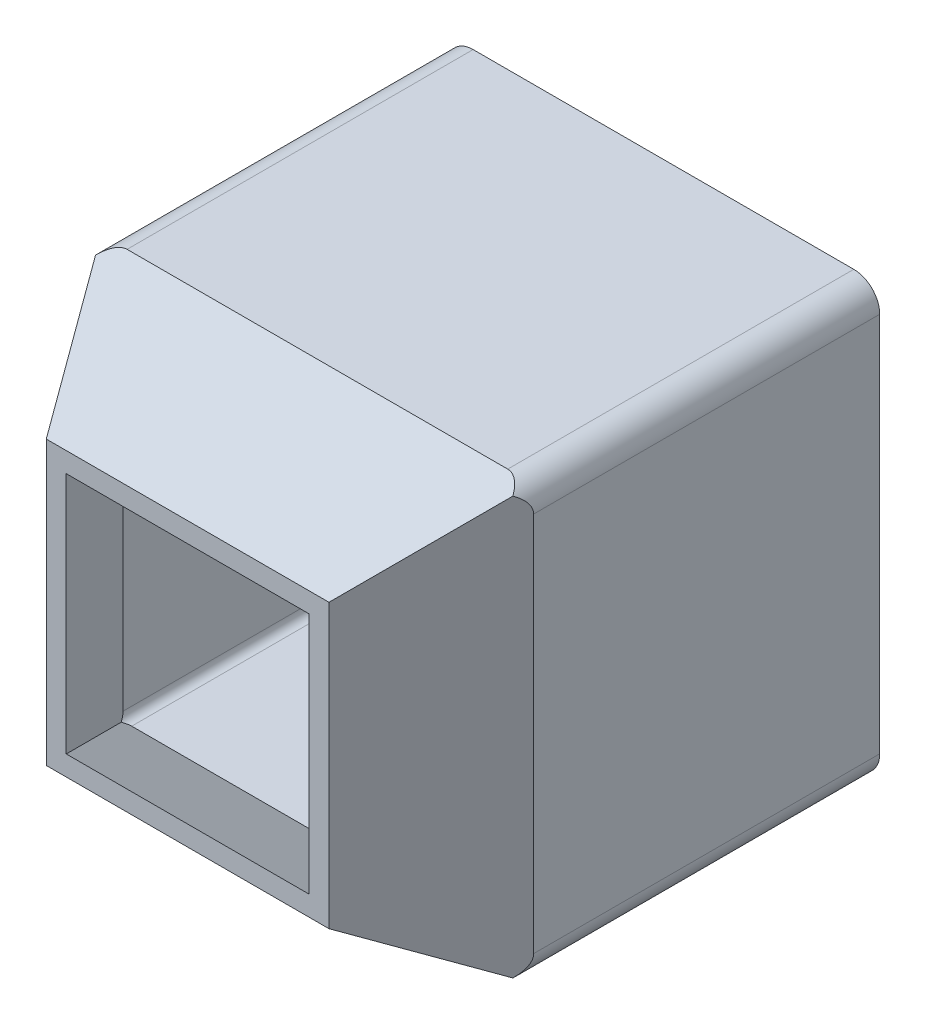
ISO-10303-21;
HEADER;
FILE_DESCRIPTION(('STEP AP214'),'2;1');
FILE_NAME('part.step','',(''),(''),'','','');
FILE_SCHEMA(('AUTOMOTIVE_DESIGN { 1 0 10303 214 1 1 1 1 }'));
ENDSEC;
DATA;
#1=APPLICATION_CONTEXT('core data for automotive mechanical design processes');
#2=APPLICATION_PROTOCOL_DEFINITION('international standard','automotive_design',2000,#1);
#3=PRODUCT_CONTEXT('',#1,'mechanical');
#4=PRODUCT('Part','Part','',(#3));
#5=PRODUCT_RELATED_PRODUCT_CATEGORY('part','',(#4));
#6=PRODUCT_DEFINITION_FORMATION('','',#4);
#7=PRODUCT_DEFINITION_CONTEXT('part definition',#1,'design');
#8=PRODUCT_DEFINITION('design','',#6,#7);
#9=PRODUCT_DEFINITION_SHAPE('','',#8);
#10=(LENGTH_UNIT() NAMED_UNIT(*) SI_UNIT(.MILLI.,.METRE.));
#11=(NAMED_UNIT(*) PLANE_ANGLE_UNIT() SI_UNIT($,.RADIAN.));
#12=(NAMED_UNIT(*) SI_UNIT($,.STERADIAN.) SOLID_ANGLE_UNIT());
#13=UNCERTAINTY_MEASURE_WITH_UNIT(LENGTH_MEASURE(1.E-05),#10,'distance_accuracy_value','');
#14=(GEOMETRIC_REPRESENTATION_CONTEXT(3) GLOBAL_UNCERTAINTY_ASSIGNED_CONTEXT((#13)) GLOBAL_UNIT_ASSIGNED_CONTEXT((#10,
#11,#12)) REPRESENTATION_CONTEXT('',''));
#15=CARTESIAN_POINT('',(0.,0.,0.));
#16=DIRECTION('',(0.,0.,1.));
#17=DIRECTION('',(1.,0.,0.));
#18=AXIS2_PLACEMENT_3D('',#15,#16,#17);
#19=CARTESIAN_POINT('',(0.,0.,-40.));
#20=DIRECTION('',(0.,0.,1.));
#21=DIRECTION('',(1.,0.,0.));
#22=AXIS2_PLACEMENT_3D('',#19,#20,#21);
#23=PLANE('',#22);
#24=DIRECTION('',(1.,0.,0.));
#25=VECTOR('',#24,1.);
#26=CARTESIAN_POINT('',(-20.,7.5,-40.));
#27=LINE('',#26,#25);
#28=CARTESIAN_POINT('',(-17.,7.5,-40.));
#29=VERTEX_POINT('',#28);
#30=CARTESIAN_POINT('',(27.,7.5,-40.));
#31=VERTEX_POINT('',#30);
#32=EDGE_CURVE('E318',#29,#31,#27,.T.);
#33=ORIENTED_EDGE('',*,*,#32,.F.);
#34=CARTESIAN_POINT('',(-17.,10.5,-40.));
#35=DIRECTION('',(0.,0.,1.));
#36=DIRECTION('',(1.,0.,0.));
#37=AXIS2_PLACEMENT_3D('',#34,#35,#36);
#38=CIRCLE('',#37,3.);
#39=CARTESIAN_POINT('',(-20.,10.5,-40.));
#40=VERTEX_POINT('',#39);
#41=EDGE_CURVE('E355',#29,#40,#38,.F.);
#42=ORIENTED_EDGE('',*,*,#41,.T.);
#43=DIRECTION('',(0.,-1.,0.));
#44=VECTOR('',#43,1.);
#45=CARTESIAN_POINT('',(-20.,57.5,-40.));
#46=LINE('',#45,#44);
#47=CARTESIAN_POINT('',(-20.,54.5,-40.));
#48=VERTEX_POINT('',#47);
#49=EDGE_CURVE('E315',#48,#40,#46,.T.);
#50=ORIENTED_EDGE('',*,*,#49,.F.);
#51=CARTESIAN_POINT('',(-17.,54.5,-40.));
#52=DIRECTION('',(0.,0.,1.));
#53=DIRECTION('',(1.,0.,0.));
#54=AXIS2_PLACEMENT_3D('',#51,#52,#53);
#55=CIRCLE('',#54,3.);
#56=CARTESIAN_POINT('',(-17.,57.5,-40.));
#57=VERTEX_POINT('',#56);
#58=EDGE_CURVE('E349',#48,#57,#55,.F.);
#59=ORIENTED_EDGE('',*,*,#58,.T.);
#60=DIRECTION('',(-1.,0.,0.));
#61=VECTOR('',#60,1.);
#62=CARTESIAN_POINT('',(-20.,57.5,-40.));
#63=LINE('',#62,#61);
#64=CARTESIAN_POINT('',(27.,57.5,-40.));
#65=VERTEX_POINT('',#64);
#66=EDGE_CURVE('E311',#65,#57,#63,.T.);
#67=ORIENTED_EDGE('',*,*,#66,.F.);
#68=CARTESIAN_POINT('',(27.,54.5,-40.));
#69=DIRECTION('',(0.,0.,1.));
#70=DIRECTION('',(1.,0.,0.));
#71=AXIS2_PLACEMENT_3D('',#68,#69,#70);
#72=CIRCLE('',#71,3.);
#73=CARTESIAN_POINT('',(30.,54.5,-40.));
#74=VERTEX_POINT('',#73);
#75=EDGE_CURVE('E351',#65,#74,#72,.F.);
#76=ORIENTED_EDGE('',*,*,#75,.T.);
#77=DIRECTION('',(0.,1.,0.));
#78=VECTOR('',#77,1.);
#79=CARTESIAN_POINT('',(30.,57.5,-40.));
#80=LINE('',#79,#78);
#81=CARTESIAN_POINT('',(30.,10.5,-40.));
#82=VERTEX_POINT('',#81);
#83=EDGE_CURVE('E308',#82,#74,#80,.T.);
#84=ORIENTED_EDGE('',*,*,#83,.F.);
#85=CARTESIAN_POINT('',(27.,10.5,-40.));
#86=DIRECTION('',(0.,0.,1.));
#87=DIRECTION('',(1.,0.,0.));
#88=AXIS2_PLACEMENT_3D('',#85,#86,#87);
#89=CIRCLE('',#88,3.);
#90=EDGE_CURVE('E353',#82,#31,#89,.F.);
#91=ORIENTED_EDGE('',*,*,#90,.T.);
#92=EDGE_LOOP('',(#33,#42,#50,#59,#67,#76,#84,#91));
#93=FACE_BOUND('',#92,.T.);
#94=CARTESIAN_POINT('',(-17.,10.5,-40.));
#95=DIRECTION('',(0.,0.,1.));
#96=DIRECTION('',(1.,0.,0.));
#97=AXIS2_PLACEMENT_3D('',#94,#95,#96);
#98=CIRCLE('',#97,1.);
#99=CARTESIAN_POINT('',(-17.,9.5,-40.));
#100=VERTEX_POINT('',#99);
#101=CARTESIAN_POINT('',(-18.,10.5,-40.));
#102=VERTEX_POINT('',#101);
#103=EDGE_CURVE('E225',#100,#102,#98,.F.);
#104=ORIENTED_EDGE('',*,*,#103,.F.);
#105=DIRECTION('',(1.,0.,0.));
#106=VECTOR('',#105,1.);
#107=CARTESIAN_POINT('',(0.,9.5,-40.));
#108=LINE('',#107,#106);
#109=CARTESIAN_POINT('',(27.,9.5,-40.));
#110=VERTEX_POINT('',#109);
#111=EDGE_CURVE('E253',#100,#110,#108,.T.);
#112=ORIENTED_EDGE('',*,*,#111,.T.);
#113=CARTESIAN_POINT('',(27.,10.5,-40.));
#114=DIRECTION('',(0.,0.,1.));
#115=DIRECTION('',(1.,0.,0.));
#116=AXIS2_PLACEMENT_3D('',#113,#114,#115);
#117=CIRCLE('',#116,1.);
#118=CARTESIAN_POINT('',(28.,10.5,-40.));
#119=VERTEX_POINT('',#118);
#120=EDGE_CURVE('E267',#119,#110,#117,.F.);
#121=ORIENTED_EDGE('',*,*,#120,.F.);
#122=DIRECTION('',(0.,1.,0.));
#123=VECTOR('',#122,1.);
#124=CARTESIAN_POINT('',(28.,0.,-40.));
#125=LINE('',#124,#123);
#126=CARTESIAN_POINT('',(28.,54.5,-40.));
#127=VERTEX_POINT('',#126);
#128=EDGE_CURVE('E47',#119,#127,#125,.T.);
#129=ORIENTED_EDGE('',*,*,#128,.T.);
#130=CARTESIAN_POINT('',(27.,54.5,-40.));
#131=DIRECTION('',(0.,0.,1.));
#132=DIRECTION('',(1.,0.,0.));
#133=AXIS2_PLACEMENT_3D('',#130,#131,#132);
#134=CIRCLE('',#133,1.);
#135=CARTESIAN_POINT('',(27.,55.5,-40.));
#136=VERTEX_POINT('',#135);
#137=EDGE_CURVE('E269',#136,#127,#134,.F.);
#138=ORIENTED_EDGE('',*,*,#137,.F.);
#139=DIRECTION('',(-1.,0.,0.));
#140=VECTOR('',#139,1.);
#141=CARTESIAN_POINT('',(0.,55.5,-40.));
#142=LINE('',#141,#140);
#143=CARTESIAN_POINT('',(-17.,55.5,-40.));
#144=VERTEX_POINT('',#143);
#145=EDGE_CURVE('E266',#136,#144,#142,.T.);
#146=ORIENTED_EDGE('',*,*,#145,.T.);
#147=CARTESIAN_POINT('',(-17.,54.5,-40.));
#148=DIRECTION('',(0.,0.,1.));
#149=DIRECTION('',(1.,0.,0.));
#150=AXIS2_PLACEMENT_3D('',#147,#148,#149);
#151=CIRCLE('',#150,1.);
#152=CARTESIAN_POINT('',(-18.,54.5,-40.));
#153=VERTEX_POINT('',#152);
#154=EDGE_CURVE('E242',#153,#144,#151,.F.);
#155=ORIENTED_EDGE('',*,*,#154,.F.);
#156=DIRECTION('',(0.,-1.,0.));
#157=VECTOR('',#156,1.);
#158=CARTESIAN_POINT('',(-18.,0.,-40.));
#159=LINE('',#158,#157);
#160=EDGE_CURVE('E272',#153,#102,#159,.T.);
#161=ORIENTED_EDGE('',*,*,#160,.T.);
#162=EDGE_LOOP('',(#104,#112,#121,#129,#138,#146,#155,#161));
#163=FACE_BOUND('',#162,.T.);
#164=ADVANCED_FACE('F32',(#93,#163),#23,.F.);
#165=CARTESIAN_POINT('',(30.,57.5,-40.));
#166=DIRECTION('',(1.,0.,0.));
#167=DIRECTION('',(0.,1.,0.));
#168=AXIS2_PLACEMENT_3D('',#165,#166,#167);
#169=PLANE('',#168);
#170=DIRECTION('',(0.,1.,0.));
#171=VECTOR('',#170,1.);
#172=CARTESIAN_POINT('',(30.,57.5,0.));
#173=LINE('',#172,#171);
#174=CARTESIAN_POINT('',(30.,10.5,0.));
#175=VERTEX_POINT('',#174);
#176=CARTESIAN_POINT('',(30.,54.5,0.));
#177=VERTEX_POINT('',#176);
#178=EDGE_CURVE('E290',#175,#177,#173,.T.);
#179=ORIENTED_EDGE('',*,*,#178,.F.);
#180=DIRECTION('',(0.,0.,1.));
#181=VECTOR('',#180,1.);
#182=CARTESIAN_POINT('',(30.,10.5,-40.));
#183=LINE('',#182,#181);
#184=EDGE_CURVE('E364',#175,#82,#183,.F.);
#185=ORIENTED_EDGE('',*,*,#184,.T.);
#186=ORIENTED_EDGE('',*,*,#83,.T.);
#187=DIRECTION('',(0.,0.,1.));
#188=VECTOR('',#187,1.);
#189=CARTESIAN_POINT('',(30.,54.5,-40.));
#190=LINE('',#189,#188);
#191=EDGE_CURVE('E361',#74,#177,#190,.T.);
#192=ORIENTED_EDGE('',*,*,#191,.T.);
#193=EDGE_LOOP('',(#179,#185,#186,#192));
#194=FACE_BOUND('',#193,.T.);
#195=ADVANCED_FACE('F413',(#194),#169,.T.);
#196=CARTESIAN_POINT('',(-20.,7.5,-40.));
#197=DIRECTION('',(0.,-1.,0.));
#198=DIRECTION('',(0.,0.,-1.));
#199=AXIS2_PLACEMENT_3D('',#196,#197,#198);
#200=PLANE('',#199);
#201=DIRECTION('',(1.,0.,0.));
#202=VECTOR('',#201,1.);
#203=CARTESIAN_POINT('',(-20.,7.5,0.));
#204=LINE('',#203,#202);
#205=CARTESIAN_POINT('',(-17.,7.5,0.));
#206=VERTEX_POINT('',#205);
#207=CARTESIAN_POINT('',(27.,7.5,0.));
#208=VERTEX_POINT('',#207);
#209=EDGE_CURVE('E312',#206,#208,#204,.T.);
#210=ORIENTED_EDGE('',*,*,#209,.F.);
#211=DIRECTION('',(0.,0.,1.));
#212=VECTOR('',#211,1.);
#213=CARTESIAN_POINT('',(-17.,7.5,-40.));
#214=LINE('',#213,#212);
#215=EDGE_CURVE('E347',#206,#29,#214,.F.);
#216=ORIENTED_EDGE('',*,*,#215,.T.);
#217=ORIENTED_EDGE('',*,*,#32,.T.);
#218=DIRECTION('',(0.,0.,1.));
#219=VECTOR('',#218,1.);
#220=CARTESIAN_POINT('',(27.,7.5,-40.));
#221=LINE('',#220,#219);
#222=EDGE_CURVE('E344',#31,#208,#221,.T.);
#223=ORIENTED_EDGE('',*,*,#222,.T.);
#224=EDGE_LOOP('',(#210,#216,#217,#223));
#225=FACE_BOUND('',#224,.T.);
#226=ADVANCED_FACE('F421',(#225),#200,.T.);
#227=CARTESIAN_POINT('',(-20.,57.5,-40.));
#228=DIRECTION('',(-1.,0.,0.));
#229=DIRECTION('',(0.,-1.,0.));
#230=AXIS2_PLACEMENT_3D('',#227,#228,#229);
#231=PLANE('',#230);
#232=ORIENTED_EDGE('',*,*,#49,.T.);
#233=DIRECTION('',(0.,0.,1.));
#234=VECTOR('',#233,1.);
#235=CARTESIAN_POINT('',(-20.,10.5,-40.));
#236=LINE('',#235,#234);
#237=CARTESIAN_POINT('',(-20.,10.5,0.));
#238=VERTEX_POINT('',#237);
#239=EDGE_CURVE('E333',#40,#238,#236,.T.);
#240=ORIENTED_EDGE('',*,*,#239,.T.);
#241=DIRECTION('',(0.,-1.,0.));
#242=VECTOR('',#241,1.);
#243=CARTESIAN_POINT('',(-20.,57.5,0.));
#244=LINE('',#243,#242);
#245=CARTESIAN_POINT('',(-20.,54.5,0.));
#246=VERTEX_POINT('',#245);
#247=EDGE_CURVE('E327',#246,#238,#244,.T.);
#248=ORIENTED_EDGE('',*,*,#247,.F.);
#249=DIRECTION('',(0.,0.,1.));
#250=VECTOR('',#249,1.);
#251=CARTESIAN_POINT('',(-20.,54.5,-40.));
#252=LINE('',#251,#250);
#253=EDGE_CURVE('E321',#246,#48,#252,.F.);
#254=ORIENTED_EDGE('',*,*,#253,.T.);
#255=EDGE_LOOP('',(#232,#240,#248,#254));
#256=FACE_BOUND('',#255,.T.);
#257=ADVANCED_FACE('F397',(#256),#231,.T.);
#258=CARTESIAN_POINT('',(-20.,57.5,-40.));
#259=DIRECTION('',(0.,1.,0.));
#260=DIRECTION('',(0.,0.,1.));
#261=AXIS2_PLACEMENT_3D('',#258,#259,#260);
#262=PLANE('',#261);
#263=DIRECTION('',(-1.,0.,0.));
#264=VECTOR('',#263,1.);
#265=CARTESIAN_POINT('',(-20.,57.5,0.));
#266=LINE('',#265,#264);
#267=CARTESIAN_POINT('',(27.,57.5,0.));
#268=VERTEX_POINT('',#267);
#269=CARTESIAN_POINT('',(-17.,57.5,0.));
#270=VERTEX_POINT('',#269);
#271=EDGE_CURVE('E324',#268,#270,#266,.T.);
#272=ORIENTED_EDGE('',*,*,#271,.F.);
#273=DIRECTION('',(0.,0.,1.));
#274=VECTOR('',#273,1.);
#275=CARTESIAN_POINT('',(27.,57.5,-40.));
#276=LINE('',#275,#274);
#277=EDGE_CURVE('E11',#268,#65,#276,.F.);
#278=ORIENTED_EDGE('',*,*,#277,.T.);
#279=ORIENTED_EDGE('',*,*,#66,.T.);
#280=DIRECTION('',(0.,0.,1.));
#281=VECTOR('',#280,1.);
#282=CARTESIAN_POINT('',(-17.,57.5,-40.));
#283=LINE('',#282,#281);
#284=EDGE_CURVE('E40',#57,#270,#283,.T.);
#285=ORIENTED_EDGE('',*,*,#284,.T.);
#286=EDGE_LOOP('',(#272,#278,#279,#285));
#287=FACE_BOUND('',#286,.T.);
#288=ADVANCED_FACE('F373',(#287),#262,.T.);
#289=CARTESIAN_POINT('',(-20.,7.5,0.));
#290=DIRECTION('',(0.,-0.866025403784438,0.500000000000001));
#291=DIRECTION('',(0.,-0.500000000000001,-0.866025403784438));
#292=AXIS2_PLACEMENT_3D('',#289,#290,#291);
#293=PLANE('',#292);
#294=DIRECTION('',(-0.447213595499959,-0.447213595499959,-0.774596669241483));
#295=VECTOR('',#294,1.);
#296=CARTESIAN_POINT('',(-20.,7.5,0.));
#297=LINE('',#296,#295);
#298=CARTESIAN_POINT('',(-11.3397459621556,16.1602540378444,15.));
#299=VERTEX_POINT('',#298);
#300=CARTESIAN_POINT('',(-19.1213203435596,8.37867965644035,1.52191780853186));
#301=VERTEX_POINT('',#300);
#302=EDGE_CURVE('E292',#299,#301,#297,.T.);
#303=ORIENTED_EDGE('',*,*,#302,.T.);
#304=CARTESIAN_POINT('',(-17.,10.5,5.19615242270662));
#305=DIRECTION('',(0.,-0.866025403784438,0.500000000000001));
#306=DIRECTION('',(0.,0.500000000000001,0.866025403784438));
#307=AXIS2_PLACEMENT_3D('',#304,#305,#306);
#308=ELLIPSE('',#307,5.99999999999999,3.);
#309=EDGE_CURVE('E342',#301,#206,#308,.T.);
#310=ORIENTED_EDGE('',*,*,#309,.T.);
#311=ORIENTED_EDGE('',*,*,#209,.T.);
#312=CARTESIAN_POINT('',(27.,10.5,5.19615242270662));
#313=DIRECTION('',(0.,-0.866025403784438,0.500000000000001));
#314=DIRECTION('',(0.,0.500000000000001,0.866025403784438));
#315=AXIS2_PLACEMENT_3D('',#312,#313,#314);
#316=ELLIPSE('',#315,5.99999999999999,3.);
#317=CARTESIAN_POINT('',(29.1213203435597,8.37867965644035,1.52191780853186));
#318=VERTEX_POINT('',#317);
#319=EDGE_CURVE('E340',#208,#318,#316,.T.);
#320=ORIENTED_EDGE('',*,*,#319,.T.);
#321=DIRECTION('',(0.447213595499959,-0.447213595499959,-0.774596669241482));
#322=VECTOR('',#321,1.);
#323=CARTESIAN_POINT('',(30.,7.5,0.));
#324=LINE('',#323,#322);
#325=CARTESIAN_POINT('',(21.3397459621556,16.1602540378444,15.));
#326=VERTEX_POINT('',#325);
#327=EDGE_CURVE('E287',#326,#318,#324,.T.);
#328=ORIENTED_EDGE('',*,*,#327,.F.);
#329=DIRECTION('',(-1.,0.,0.));
#330=VECTOR('',#329,1.);
#331=CARTESIAN_POINT('',(-20.,16.1602540378444,15.));
#332=LINE('',#331,#330);
#333=EDGE_CURVE('E262',#299,#326,#332,.F.);
#334=ORIENTED_EDGE('',*,*,#333,.F.);
#335=EDGE_LOOP('',(#303,#310,#311,#320,#328,#334));
#336=FACE_BOUND('',#335,.T.);
#337=ADVANCED_FACE('F427',(#336),#293,.T.);
#338=CARTESIAN_POINT('',(30.,7.5,0.));
#339=DIRECTION('',(0.866025403784438,0.,0.500000000000001));
#340=DIRECTION('',(0.500000000000001,0.,-0.866025403784438));
#341=AXIS2_PLACEMENT_3D('',#338,#339,#340);
#342=PLANE('',#341);
#343=ORIENTED_EDGE('',*,*,#327,.T.);
#344=CARTESIAN_POINT('',(27.,10.5,5.19615242270662));
#345=DIRECTION('',(0.866025403784438,0.,0.500000000000001));
#346=DIRECTION('',(-0.500000000000001,0.,0.866025403784438));
#347=AXIS2_PLACEMENT_3D('',#344,#345,#346);
#348=ELLIPSE('',#347,5.99999999999999,3.);
#349=EDGE_CURVE('E359',#318,#175,#348,.T.);
#350=ORIENTED_EDGE('',*,*,#349,.T.);
#351=ORIENTED_EDGE('',*,*,#178,.T.);
#352=CARTESIAN_POINT('',(27.,54.5,5.19615242270662));
#353=DIRECTION('',(0.866025403784438,0.,0.500000000000001));
#354=DIRECTION('',(-0.500000000000001,0.,0.866025403784438));
#355=AXIS2_PLACEMENT_3D('',#352,#353,#354);
#356=ELLIPSE('',#355,5.99999999999999,3.);
#357=CARTESIAN_POINT('',(29.1213203435596,56.6213203435596,1.52191780853186));
#358=VERTEX_POINT('',#357);
#359=EDGE_CURVE('E357',#177,#358,#356,.T.);
#360=ORIENTED_EDGE('',*,*,#359,.T.);
#361=DIRECTION('',(0.447213595499959,0.447213595499959,-0.774596669241483));
#362=VECTOR('',#361,1.);
#363=CARTESIAN_POINT('',(30.,57.5,0.));
#364=LINE('',#363,#362);
#365=CARTESIAN_POINT('',(21.3397459621556,48.8397459621556,15.));
#366=VERTEX_POINT('',#365);
#367=EDGE_CURVE('E291',#366,#358,#364,.T.);
#368=ORIENTED_EDGE('',*,*,#367,.F.);
#369=DIRECTION('',(0.,-1.,0.));
#370=VECTOR('',#369,1.);
#371=CARTESIAN_POINT('',(21.3397459621556,7.49999999999999,15.));
#372=LINE('',#371,#370);
#373=EDGE_CURVE('E303',#326,#366,#372,.F.);
#374=ORIENTED_EDGE('',*,*,#373,.F.);
#375=EDGE_LOOP('',(#343,#350,#351,#360,#368,#374));
#376=FACE_BOUND('',#375,.T.);
#377=ADVANCED_FACE('F408',(#376),#342,.T.);
#378=CARTESIAN_POINT('',(30.,57.5,0.));
#379=DIRECTION('',(0.,0.866025403784438,0.500000000000001));
#380=DIRECTION('',(0.,-0.500000000000001,0.866025403784438));
#381=AXIS2_PLACEMENT_3D('',#378,#379,#380);
#382=PLANE('',#381);
#383=ORIENTED_EDGE('',*,*,#367,.T.);
#384=CARTESIAN_POINT('',(27.,54.5,5.19615242270663));
#385=DIRECTION('',(0.,0.866025403784438,0.500000000000001));
#386=DIRECTION('',(0.,-0.500000000000001,0.866025403784438));
#387=AXIS2_PLACEMENT_3D('',#384,#385,#386);
#388=ELLIPSE('',#387,5.99999999999999,3.);
#389=EDGE_CURVE('E368',#358,#268,#388,.T.);
#390=ORIENTED_EDGE('',*,*,#389,.T.);
#391=ORIENTED_EDGE('',*,*,#271,.T.);
#392=CARTESIAN_POINT('',(-17.,54.5,5.19615242270663));
#393=DIRECTION('',(0.,0.866025403784438,0.500000000000001));
#394=DIRECTION('',(0.,-0.500000000000001,0.866025403784438));
#395=AXIS2_PLACEMENT_3D('',#392,#393,#394);
#396=ELLIPSE('',#395,5.99999999999999,3.);
#397=CARTESIAN_POINT('',(-19.1213203435596,56.6213203435596,1.52191780853186));
#398=VERTEX_POINT('',#397);
#399=EDGE_CURVE('E366',#270,#398,#396,.T.);
#400=ORIENTED_EDGE('',*,*,#399,.T.);
#401=DIRECTION('',(-0.447213595499959,0.447213595499959,-0.774596669241482));
#402=VECTOR('',#401,1.);
#403=CARTESIAN_POINT('',(-20.,57.5,0.));
#404=LINE('',#403,#402);
#405=CARTESIAN_POINT('',(-11.3397459621556,48.8397459621556,15.));
#406=VERTEX_POINT('',#405);
#407=EDGE_CURVE('E295',#406,#398,#404,.T.);
#408=ORIENTED_EDGE('',*,*,#407,.F.);
#409=DIRECTION('',(1.,0.,0.));
#410=VECTOR('',#409,1.);
#411=CARTESIAN_POINT('',(30.,48.8397459621556,15.));
#412=LINE('',#411,#410);
#413=EDGE_CURVE('E305',#366,#406,#412,.F.);
#414=ORIENTED_EDGE('',*,*,#413,.F.);
#415=EDGE_LOOP('',(#383,#390,#391,#400,#408,#414));
#416=FACE_BOUND('',#415,.T.);
#417=ADVANCED_FACE('F379',(#416),#382,.T.);
#418=CARTESIAN_POINT('',(-20.,57.5,0.));
#419=DIRECTION('',(-0.866025403784438,0.,0.500000000000001));
#420=DIRECTION('',(0.500000000000001,0.,0.866025403784438));
#421=AXIS2_PLACEMENT_3D('',#418,#419,#420);
#422=PLANE('',#421);
#423=ORIENTED_EDGE('',*,*,#247,.T.);
#424=CARTESIAN_POINT('',(-17.,10.5,5.19615242270662));
#425=DIRECTION('',(-0.866025403784438,0.,0.500000000000001));
#426=DIRECTION('',(0.500000000000001,0.,0.866025403784438));
#427=AXIS2_PLACEMENT_3D('',#424,#425,#426);
#428=ELLIPSE('',#427,5.99999999999999,3.);
#429=EDGE_CURVE('E338',#238,#301,#428,.T.);
#430=ORIENTED_EDGE('',*,*,#429,.T.);
#431=ORIENTED_EDGE('',*,*,#302,.F.);
#432=DIRECTION('',(0.,1.,0.));
#433=VECTOR('',#432,1.);
#434=CARTESIAN_POINT('',(-11.3397459621556,57.5,15.));
#435=LINE('',#434,#433);
#436=EDGE_CURVE('E296',#406,#299,#435,.F.);
#437=ORIENTED_EDGE('',*,*,#436,.F.);
#438=ORIENTED_EDGE('',*,*,#407,.T.);
#439=CARTESIAN_POINT('',(-17.,54.5,5.19615242270662));
#440=DIRECTION('',(-0.866025403784438,0.,0.500000000000001));
#441=DIRECTION('',(0.500000000000001,0.,0.866025403784438));
#442=AXIS2_PLACEMENT_3D('',#439,#440,#441);
#443=ELLIPSE('',#442,5.99999999999999,3.);
#444=EDGE_CURVE('E336',#398,#246,#443,.T.);
#445=ORIENTED_EDGE('',*,*,#444,.T.);
#446=EDGE_LOOP('',(#423,#430,#431,#437,#438,#445));
#447=FACE_BOUND('',#446,.T.);
#448=ADVANCED_FACE('F400',(#447),#422,.T.);
#449=CARTESIAN_POINT('',(0.,0.,15.));
#450=DIRECTION('',(0.,0.,1.));
#451=DIRECTION('',(1.,0.,0.));
#452=AXIS2_PLACEMENT_3D('',#449,#450,#451);
#453=PLANE('',#452);
#454=DIRECTION('',(-1.,0.,0.));
#455=VECTOR('',#454,1.);
#456=CARTESIAN_POINT('',(-20.,18.4696551146029,15.));
#457=LINE('',#456,#455);
#458=CARTESIAN_POINT('',(-9.03034488539708,18.4696551146029,15.));
#459=VERTEX_POINT('',#458);
#460=CARTESIAN_POINT('',(19.0303448853971,18.4696551146029,15.));
#461=VERTEX_POINT('',#460);
#462=EDGE_CURVE('E283',#459,#461,#457,.F.);
#463=ORIENTED_EDGE('',*,*,#462,.F.);
#464=DIRECTION('',(0.,1.,0.));
#465=VECTOR('',#464,1.);
#466=CARTESIAN_POINT('',(-9.03034488539709,57.5,15.));
#467=LINE('',#466,#465);
#468=CARTESIAN_POINT('',(-9.03034488539709,46.5303448853971,15.));
#469=VERTEX_POINT('',#468);
#470=EDGE_CURVE('E230',#469,#459,#467,.F.);
#471=ORIENTED_EDGE('',*,*,#470,.F.);
#472=DIRECTION('',(1.,0.,0.));
#473=VECTOR('',#472,1.);
#474=CARTESIAN_POINT('',(30.,46.5303448853971,15.));
#475=LINE('',#474,#473);
#476=CARTESIAN_POINT('',(19.0303448853971,46.5303448853971,15.));
#477=VERTEX_POINT('',#476);
#478=EDGE_CURVE('E282',#477,#469,#475,.F.);
#479=ORIENTED_EDGE('',*,*,#478,.F.);
#480=DIRECTION('',(0.,-1.,0.));
#481=VECTOR('',#480,1.);
#482=CARTESIAN_POINT('',(19.0303448853971,7.49999999999999,15.));
#483=LINE('',#482,#481);
#484=EDGE_CURVE('E280',#461,#477,#483,.F.);
#485=ORIENTED_EDGE('',*,*,#484,.F.);
#486=EDGE_LOOP('',(#463,#471,#479,#485));
#487=FACE_BOUND('',#486,.T.);
#488=ORIENTED_EDGE('',*,*,#333,.T.);
#489=ORIENTED_EDGE('',*,*,#373,.T.);
#490=ORIENTED_EDGE('',*,*,#413,.T.);
#491=ORIENTED_EDGE('',*,*,#436,.T.);
#492=EDGE_LOOP('',(#488,#489,#490,#491));
#493=FACE_BOUND('',#492,.T.);
#494=ADVANCED_FACE('F404',(#487,#493),#453,.T.);
#495=CARTESIAN_POINT('',(-17.,10.5,-40.));
#496=DIRECTION('',(0.,0.,1.));
#497=DIRECTION('',(1.,0.,0.));
#498=AXIS2_PLACEMENT_3D('',#495,#496,#497);
#499=CYLINDRICAL_SURFACE('',#498,3.);
#500=ORIENTED_EDGE('',*,*,#41,.F.);
#501=ORIENTED_EDGE('',*,*,#215,.F.);
#502=ORIENTED_EDGE('',*,*,#309,.F.);
#503=ORIENTED_EDGE('',*,*,#429,.F.);
#504=ORIENTED_EDGE('',*,*,#239,.F.);
#505=EDGE_LOOP('',(#500,#501,#502,#503,#504));
#506=FACE_BOUND('',#505,.T.);
#507=ADVANCED_FACE('F425',(#506),#499,.T.);
#508=CARTESIAN_POINT('',(27.,10.5,-40.));
#509=DIRECTION('',(0.,0.,1.));
#510=DIRECTION('',(1.,0.,0.));
#511=AXIS2_PLACEMENT_3D('',#508,#509,#510);
#512=CYLINDRICAL_SURFACE('',#511,3.);
#513=ORIENTED_EDGE('',*,*,#90,.F.);
#514=ORIENTED_EDGE('',*,*,#184,.F.);
#515=ORIENTED_EDGE('',*,*,#349,.F.);
#516=ORIENTED_EDGE('',*,*,#319,.F.);
#517=ORIENTED_EDGE('',*,*,#222,.F.);
#518=EDGE_LOOP('',(#513,#514,#515,#516,#517));
#519=FACE_BOUND('',#518,.T.);
#520=ADVANCED_FACE('F416',(#519),#512,.T.);
#521=CARTESIAN_POINT('',(27.,54.5,-40.));
#522=DIRECTION('',(0.,0.,1.));
#523=DIRECTION('',(1.,0.,0.));
#524=AXIS2_PLACEMENT_3D('',#521,#522,#523);
#525=CYLINDRICAL_SURFACE('',#524,3.);
#526=ORIENTED_EDGE('',*,*,#75,.F.);
#527=ORIENTED_EDGE('',*,*,#277,.F.);
#528=ORIENTED_EDGE('',*,*,#389,.F.);
#529=ORIENTED_EDGE('',*,*,#359,.F.);
#530=ORIENTED_EDGE('',*,*,#191,.F.);
#531=EDGE_LOOP('',(#526,#527,#528,#529,#530));
#532=FACE_BOUND('',#531,.T.);
#533=ADVANCED_FACE('F386',(#532),#525,.T.);
#534=CARTESIAN_POINT('',(-17.,54.5,-40.));
#535=DIRECTION('',(0.,0.,1.));
#536=DIRECTION('',(1.,0.,0.));
#537=AXIS2_PLACEMENT_3D('',#534,#535,#536);
#538=CYLINDRICAL_SURFACE('',#537,3.);
#539=ORIENTED_EDGE('',*,*,#58,.F.);
#540=ORIENTED_EDGE('',*,*,#253,.F.);
#541=ORIENTED_EDGE('',*,*,#444,.F.);
#542=ORIENTED_EDGE('',*,*,#399,.F.);
#543=ORIENTED_EDGE('',*,*,#284,.F.);
#544=EDGE_LOOP('',(#539,#540,#541,#542,#543));
#545=FACE_BOUND('',#544,.T.);
#546=ADVANCED_FACE('F34',(#545),#538,.T.);
#547=CARTESIAN_POINT('',(28.,57.5,-40.));
#548=DIRECTION('',(1.,0.,0.));
#549=DIRECTION('',(0.,1.,0.));
#550=AXIS2_PLACEMENT_3D('',#547,#548,#549);
#551=PLANE('',#550);
#552=DIRECTION('',(0.,-1.,0.));
#553=VECTOR('',#552,1.);
#554=CARTESIAN_POINT('',(28.,57.5,-0.535898384862239));
#555=LINE('',#554,#553);
#556=CARTESIAN_POINT('',(28.,10.5,-0.535898384862239));
#557=VERTEX_POINT('',#556);
#558=CARTESIAN_POINT('',(28.,54.5,-0.535898384862239));
#559=VERTEX_POINT('',#558);
#560=EDGE_CURVE('E208',#557,#559,#555,.F.);
#561=ORIENTED_EDGE('',*,*,#560,.T.);
#562=DIRECTION('',(0.,0.,1.));
#563=VECTOR('',#562,1.);
#564=CARTESIAN_POINT('',(28.,54.5,-40.));
#565=LINE('',#564,#563);
#566=EDGE_CURVE('E204',#127,#559,#565,.T.);
#567=ORIENTED_EDGE('',*,*,#566,.F.);
#568=ORIENTED_EDGE('',*,*,#128,.F.);
#569=DIRECTION('',(0.,0.,1.));
#570=VECTOR('',#569,1.);
#571=CARTESIAN_POINT('',(28.,10.5,-40.));
#572=LINE('',#571,#570);
#573=EDGE_CURVE('E197',#557,#119,#572,.F.);
#574=ORIENTED_EDGE('',*,*,#573,.F.);
#575=EDGE_LOOP('',(#561,#567,#568,#574));
#576=FACE_BOUND('',#575,.T.);
#577=ADVANCED_FACE('F215',(#576),#551,.F.);
#578=CARTESIAN_POINT('',(-20.,9.5,-40.));
#579=DIRECTION('',(0.,-1.,0.));
#580=DIRECTION('',(0.,0.,-1.));
#581=AXIS2_PLACEMENT_3D('',#578,#579,#580);
#582=PLANE('',#581);
#583=DIRECTION('',(-1.,0.,0.));
#584=VECTOR('',#583,1.);
#585=CARTESIAN_POINT('',(-20.,9.5,-0.535898384862246));
#586=LINE('',#585,#584);
#587=CARTESIAN_POINT('',(-17.,9.5,-0.535898384862246));
#588=VERTEX_POINT('',#587);
#589=CARTESIAN_POINT('',(27.,9.5,-0.535898384862246));
#590=VERTEX_POINT('',#589);
#591=EDGE_CURVE('E234',#588,#590,#586,.F.);
#592=ORIENTED_EDGE('',*,*,#591,.T.);
#593=DIRECTION('',(0.,0.,-1.));
#594=VECTOR('',#593,1.);
#595=CARTESIAN_POINT('',(27.,9.5,-40.));
#596=LINE('',#595,#594);
#597=EDGE_CURVE('E233',#110,#590,#596,.F.);
#598=ORIENTED_EDGE('',*,*,#597,.F.);
#599=ORIENTED_EDGE('',*,*,#111,.F.);
#600=DIRECTION('',(0.,0.,-1.));
#601=VECTOR('',#600,1.);
#602=CARTESIAN_POINT('',(-17.,9.5,-40.));
#603=LINE('',#602,#601);
#604=EDGE_CURVE('E240',#588,#100,#603,.T.);
#605=ORIENTED_EDGE('',*,*,#604,.F.);
#606=EDGE_LOOP('',(#592,#598,#599,#605));
#607=FACE_BOUND('',#606,.T.);
#608=ADVANCED_FACE('F460',(#607),#582,.F.);
#609=CARTESIAN_POINT('',(-18.,57.5,-40.));
#610=DIRECTION('',(-1.,0.,0.));
#611=DIRECTION('',(0.,-1.,0.));
#612=AXIS2_PLACEMENT_3D('',#609,#610,#611);
#613=PLANE('',#612);
#614=ORIENTED_EDGE('',*,*,#160,.F.);
#615=DIRECTION('',(0.,0.,1.));
#616=VECTOR('',#615,1.);
#617=CARTESIAN_POINT('',(-18.,54.5,-40.));
#618=LINE('',#617,#616);
#619=CARTESIAN_POINT('',(-18.,54.5,-0.535898384862239));
#620=VERTEX_POINT('',#619);
#621=EDGE_CURVE('E249',#620,#153,#618,.F.);
#622=ORIENTED_EDGE('',*,*,#621,.F.);
#623=DIRECTION('',(0.,1.,0.));
#624=VECTOR('',#623,1.);
#625=CARTESIAN_POINT('',(-18.,57.5,-0.535898384862239));
#626=LINE('',#625,#624);
#627=CARTESIAN_POINT('',(-18.,10.5,-0.535898384862239));
#628=VERTEX_POINT('',#627);
#629=EDGE_CURVE('E237',#620,#628,#626,.F.);
#630=ORIENTED_EDGE('',*,*,#629,.T.);
#631=DIRECTION('',(0.,0.,1.));
#632=VECTOR('',#631,1.);
#633=CARTESIAN_POINT('',(-18.,10.5,-40.));
#634=LINE('',#633,#632);
#635=EDGE_CURVE('E246',#102,#628,#634,.T.);
#636=ORIENTED_EDGE('',*,*,#635,.F.);
#637=EDGE_LOOP('',(#614,#622,#630,#636));
#638=FACE_BOUND('',#637,.T.);
#639=ADVANCED_FACE('F465',(#638),#613,.F.);
#640=CARTESIAN_POINT('',(-20.,55.5,-40.));
#641=DIRECTION('',(0.,1.,0.));
#642=DIRECTION('',(0.,0.,1.));
#643=AXIS2_PLACEMENT_3D('',#640,#641,#642);
#644=PLANE('',#643);
#645=DIRECTION('',(1.,0.,0.));
#646=VECTOR('',#645,1.);
#647=CARTESIAN_POINT('',(-20.,55.5,-0.535898384862246));
#648=LINE('',#647,#646);
#649=CARTESIAN_POINT('',(27.,55.5,-0.535898384862246));
#650=VERTEX_POINT('',#649);
#651=CARTESIAN_POINT('',(-17.,55.5,-0.535898384862246));
#652=VERTEX_POINT('',#651);
#653=EDGE_CURVE('E212',#650,#652,#648,.F.);
#654=ORIENTED_EDGE('',*,*,#653,.T.);
#655=DIRECTION('',(0.,0.,1.));
#656=VECTOR('',#655,1.);
#657=CARTESIAN_POINT('',(-17.,55.5,-40.));
#658=LINE('',#657,#656);
#659=EDGE_CURVE('E257',#144,#652,#658,.T.);
#660=ORIENTED_EDGE('',*,*,#659,.F.);
#661=ORIENTED_EDGE('',*,*,#145,.F.);
#662=DIRECTION('',(0.,0.,1.));
#663=VECTOR('',#662,1.);
#664=CARTESIAN_POINT('',(27.,55.5,-40.));
#665=LINE('',#664,#663);
#666=EDGE_CURVE('E260',#650,#136,#665,.F.);
#667=ORIENTED_EDGE('',*,*,#666,.F.);
#668=EDGE_LOOP('',(#654,#660,#661,#667));
#669=FACE_BOUND('',#668,.T.);
#670=ADVANCED_FACE('F471',(#669),#644,.F.);
#671=CARTESIAN_POINT('',(-20.,9.23205080756887,-1.));
#672=DIRECTION('',(0.,-0.866025403784438,0.500000000000001));
#673=DIRECTION('',(0.,-0.500000000000001,-0.866025403784438));
#674=AXIS2_PLACEMENT_3D('',#671,#672,#673);
#675=PLANE('',#674);
#676=DIRECTION('',(-0.447213595499959,-0.447213595499959,-0.774596669241483));
#677=VECTOR('',#676,1.);
#678=CARTESIAN_POINT('',(-18.6143593539449,8.88564064605509,-1.6));
#679=LINE('',#678,#677);
#680=CARTESIAN_POINT('',(-17.7071067811865,9.79289321881345,-0.0285924486849595));
#681=VERTEX_POINT('',#680);
#682=EDGE_CURVE('E227',#459,#681,#679,.T.);
#683=ORIENTED_EDGE('',*,*,#682,.F.);
#684=ORIENTED_EDGE('',*,*,#462,.T.);
#685=DIRECTION('',(0.447213595499959,-0.447213595499959,-0.774596669241482));
#686=VECTOR('',#685,1.);
#687=CARTESIAN_POINT('',(28.6143593539449,8.88564064605509,-1.6));
#688=LINE('',#687,#686);
#689=CARTESIAN_POINT('',(27.7071067811866,9.79289321881344,-0.0285924486849633));
#690=VERTEX_POINT('',#689);
#691=EDGE_CURVE('E213',#461,#690,#688,.T.);
#692=ORIENTED_EDGE('',*,*,#691,.T.);
#693=CARTESIAN_POINT('',(27.,10.5,1.19615242270663));
#694=DIRECTION('',(0.,-0.866025403784438,0.500000000000001));
#695=DIRECTION('',(0.,0.500000000000001,0.866025403784438));
#696=AXIS2_PLACEMENT_3D('',#693,#694,#695);
#697=ELLIPSE('',#696,2.,1.);
#698=EDGE_CURVE('E200',#590,#690,#697,.T.);
#699=ORIENTED_EDGE('',*,*,#698,.F.);
#700=ORIENTED_EDGE('',*,*,#591,.F.);
#701=CARTESIAN_POINT('',(-17.,10.5,1.19615242270663));
#702=DIRECTION('',(0.,-0.866025403784438,0.500000000000001));
#703=DIRECTION('',(0.,0.500000000000001,0.866025403784438));
#704=AXIS2_PLACEMENT_3D('',#701,#702,#703);
#705=ELLIPSE('',#704,2.,1.);
#706=EDGE_CURVE('E231',#681,#588,#705,.T.);
#707=ORIENTED_EDGE('',*,*,#706,.F.);
#708=EDGE_LOOP('',(#683,#684,#692,#699,#700,#707));
#709=FACE_BOUND('',#708,.T.);
#710=ADVANCED_FACE('F475',(#709),#675,.F.);
#711=CARTESIAN_POINT('',(28.2679491924311,7.5,-1.));
#712=DIRECTION('',(0.866025403784438,0.,0.500000000000001));
#713=DIRECTION('',(0.500000000000001,0.,-0.866025403784438));
#714=AXIS2_PLACEMENT_3D('',#711,#712,#713);
#715=PLANE('',#714);
#716=ORIENTED_EDGE('',*,*,#691,.F.);
#717=ORIENTED_EDGE('',*,*,#484,.T.);
#718=DIRECTION('',(0.447213595499959,0.447213595499959,-0.774596669241483));
#719=VECTOR('',#718,1.);
#720=CARTESIAN_POINT('',(28.6143593539449,56.1143593539449,-1.6));
#721=LINE('',#720,#719);
#722=CARTESIAN_POINT('',(27.7071067811865,55.2071067811866,-0.0285924486849588));
#723=VERTEX_POINT('',#722);
#724=EDGE_CURVE('E222',#477,#723,#721,.T.);
#725=ORIENTED_EDGE('',*,*,#724,.T.);
#726=CARTESIAN_POINT('',(27.,54.5,1.19615242270663));
#727=DIRECTION('',(0.866025403784438,0.,0.500000000000001));
#728=DIRECTION('',(-0.500000000000001,0.,0.866025403784438));
#729=AXIS2_PLACEMENT_3D('',#726,#727,#728);
#730=ELLIPSE('',#729,2.,1.);
#731=EDGE_CURVE('E205',#559,#723,#730,.T.);
#732=ORIENTED_EDGE('',*,*,#731,.F.);
#733=ORIENTED_EDGE('',*,*,#560,.F.);
#734=CARTESIAN_POINT('',(27.,10.5,1.19615242270662));
#735=DIRECTION('',(0.866025403784438,0.,0.500000000000001));
#736=DIRECTION('',(-0.500000000000001,0.,0.866025403784438));
#737=AXIS2_PLACEMENT_3D('',#734,#735,#736);
#738=ELLIPSE('',#737,2.,1.);
#739=EDGE_CURVE('E194',#690,#557,#738,.T.);
#740=ORIENTED_EDGE('',*,*,#739,.F.);
#741=EDGE_LOOP('',(#716,#717,#725,#732,#733,#740));
#742=FACE_BOUND('',#741,.T.);
#743=ADVANCED_FACE('F209',(#742),#715,.F.);
#744=CARTESIAN_POINT('',(30.,55.7679491924311,-1.));
#745=DIRECTION('',(0.,0.866025403784438,0.500000000000001));
#746=DIRECTION('',(0.,-0.500000000000001,0.866025403784438));
#747=AXIS2_PLACEMENT_3D('',#744,#745,#746);
#748=PLANE('',#747);
#749=ORIENTED_EDGE('',*,*,#724,.F.);
#750=ORIENTED_EDGE('',*,*,#478,.T.);
#751=DIRECTION('',(-0.447213595499959,0.447213595499959,-0.774596669241482));
#752=VECTOR('',#751,1.);
#753=CARTESIAN_POINT('',(-18.6143593539449,56.1143593539449,-1.6));
#754=LINE('',#753,#752);
#755=CARTESIAN_POINT('',(-17.7071067811866,55.2071067811866,-0.0285924486849598));
#756=VERTEX_POINT('',#755);
#757=EDGE_CURVE('E55',#469,#756,#754,.T.);
#758=ORIENTED_EDGE('',*,*,#757,.T.);
#759=CARTESIAN_POINT('',(-17.,54.5,1.19615242270663));
#760=DIRECTION('',(0.,0.866025403784438,0.500000000000001));
#761=DIRECTION('',(0.,-0.500000000000001,0.866025403784438));
#762=AXIS2_PLACEMENT_3D('',#759,#760,#761);
#763=ELLIPSE('',#762,2.,1.);
#764=EDGE_CURVE('E216',#652,#756,#763,.T.);
#765=ORIENTED_EDGE('',*,*,#764,.F.);
#766=ORIENTED_EDGE('',*,*,#653,.F.);
#767=CARTESIAN_POINT('',(27.,54.5,1.19615242270663));
#768=DIRECTION('',(0.,0.866025403784438,0.500000000000001));
#769=DIRECTION('',(0.,-0.500000000000001,0.866025403784438));
#770=AXIS2_PLACEMENT_3D('',#767,#768,#769);
#771=ELLIPSE('',#770,2.,1.);
#772=EDGE_CURVE('E218',#723,#650,#771,.T.);
#773=ORIENTED_EDGE('',*,*,#772,.F.);
#774=EDGE_LOOP('',(#749,#750,#758,#765,#766,#773));
#775=FACE_BOUND('',#774,.T.);
#776=ADVANCED_FACE('F482',(#775),#748,.F.);
#777=CARTESIAN_POINT('',(-18.2679491924311,57.5,-1.));
#778=DIRECTION('',(-0.866025403784438,0.,0.500000000000001));
#779=DIRECTION('',(0.500000000000001,0.,0.866025403784438));
#780=AXIS2_PLACEMENT_3D('',#777,#778,#779);
#781=PLANE('',#780);
#782=ORIENTED_EDGE('',*,*,#629,.F.);
#783=CARTESIAN_POINT('',(-17.,54.5,1.19615242270663));
#784=DIRECTION('',(-0.866025403784438,0.,0.500000000000001));
#785=DIRECTION('',(0.500000000000001,0.,0.866025403784438));
#786=AXIS2_PLACEMENT_3D('',#783,#784,#785);
#787=ELLIPSE('',#786,2.,1.);
#788=EDGE_CURVE('E245',#756,#620,#787,.T.);
#789=ORIENTED_EDGE('',*,*,#788,.F.);
#790=ORIENTED_EDGE('',*,*,#757,.F.);
#791=ORIENTED_EDGE('',*,*,#470,.T.);
#792=ORIENTED_EDGE('',*,*,#682,.T.);
#793=CARTESIAN_POINT('',(-17.,10.5,1.19615242270663));
#794=DIRECTION('',(-0.866025403784438,0.,0.500000000000001));
#795=DIRECTION('',(0.500000000000001,0.,0.866025403784438));
#796=AXIS2_PLACEMENT_3D('',#793,#794,#795);
#797=ELLIPSE('',#796,2.,1.);
#798=EDGE_CURVE('E239',#628,#681,#797,.T.);
#799=ORIENTED_EDGE('',*,*,#798,.F.);
#800=EDGE_LOOP('',(#782,#789,#790,#791,#792,#799));
#801=FACE_BOUND('',#800,.T.);
#802=ADVANCED_FACE('F485',(#801),#781,.F.);
#803=CARTESIAN_POINT('',(-17.,10.5,-40.));
#804=DIRECTION('',(0.,0.,1.));
#805=DIRECTION('',(1.,0.,0.));
#806=AXIS2_PLACEMENT_3D('',#803,#804,#805);
#807=CYLINDRICAL_SURFACE('',#806,1.);
#808=ORIENTED_EDGE('',*,*,#103,.T.);
#809=ORIENTED_EDGE('',*,*,#635,.T.);
#810=ORIENTED_EDGE('',*,*,#798,.T.);
#811=ORIENTED_EDGE('',*,*,#706,.T.);
#812=ORIENTED_EDGE('',*,*,#604,.T.);
#813=EDGE_LOOP('',(#808,#809,#810,#811,#812));
#814=FACE_BOUND('',#813,.T.);
#815=ADVANCED_FACE('F489',(#814),#807,.F.);
#816=CARTESIAN_POINT('',(27.,10.5,-40.));
#817=DIRECTION('',(0.,0.,1.));
#818=DIRECTION('',(1.,0.,0.));
#819=AXIS2_PLACEMENT_3D('',#816,#817,#818);
#820=CYLINDRICAL_SURFACE('',#819,1.);
#821=ORIENTED_EDGE('',*,*,#120,.T.);
#822=ORIENTED_EDGE('',*,*,#597,.T.);
#823=ORIENTED_EDGE('',*,*,#698,.T.);
#824=ORIENTED_EDGE('',*,*,#739,.T.);
#825=ORIENTED_EDGE('',*,*,#573,.T.);
#826=EDGE_LOOP('',(#821,#822,#823,#824,#825));
#827=FACE_BOUND('',#826,.T.);
#828=ADVANCED_FACE('F196',(#827),#820,.F.);
#829=CARTESIAN_POINT('',(27.,54.5,-40.));
#830=DIRECTION('',(0.,0.,1.));
#831=DIRECTION('',(1.,0.,0.));
#832=AXIS2_PLACEMENT_3D('',#829,#830,#831);
#833=CYLINDRICAL_SURFACE('',#832,1.);
#834=ORIENTED_EDGE('',*,*,#137,.T.);
#835=ORIENTED_EDGE('',*,*,#566,.T.);
#836=ORIENTED_EDGE('',*,*,#731,.T.);
#837=ORIENTED_EDGE('',*,*,#772,.T.);
#838=ORIENTED_EDGE('',*,*,#666,.T.);
#839=EDGE_LOOP('',(#834,#835,#836,#837,#838));
#840=FACE_BOUND('',#839,.T.);
#841=ADVANCED_FACE('F495',(#840),#833,.F.);
#842=CARTESIAN_POINT('',(-17.,54.5,-40.));
#843=DIRECTION('',(0.,0.,1.));
#844=DIRECTION('',(1.,0.,0.));
#845=AXIS2_PLACEMENT_3D('',#842,#843,#844);
#846=CYLINDRICAL_SURFACE('',#845,1.);
#847=ORIENTED_EDGE('',*,*,#154,.T.);
#848=ORIENTED_EDGE('',*,*,#659,.T.);
#849=ORIENTED_EDGE('',*,*,#764,.T.);
#850=ORIENTED_EDGE('',*,*,#788,.T.);
#851=ORIENTED_EDGE('',*,*,#621,.T.);
#852=EDGE_LOOP('',(#847,#848,#849,#850,#851));
#853=FACE_BOUND('',#852,.T.);
#854=ADVANCED_FACE('F498',(#853),#846,.F.);
#855=CLOSED_SHELL('',(#164,#195,#226,#257,#288,#337,#377,#417,#448,#494,#507,#520,#533,#546,
#577,#608,#639,#670,#710,#743,#776,#802,#815,#828,#841,#854));
#856=MANIFOLD_SOLID_BREP('B2',#855);
#857=ADVANCED_BREP_SHAPE_REPRESENTATION('',(#18,#856),#14);
#858=SHAPE_DEFINITION_REPRESENTATION(#9,#857);
ENDSEC;
END-ISO-10303-21;
